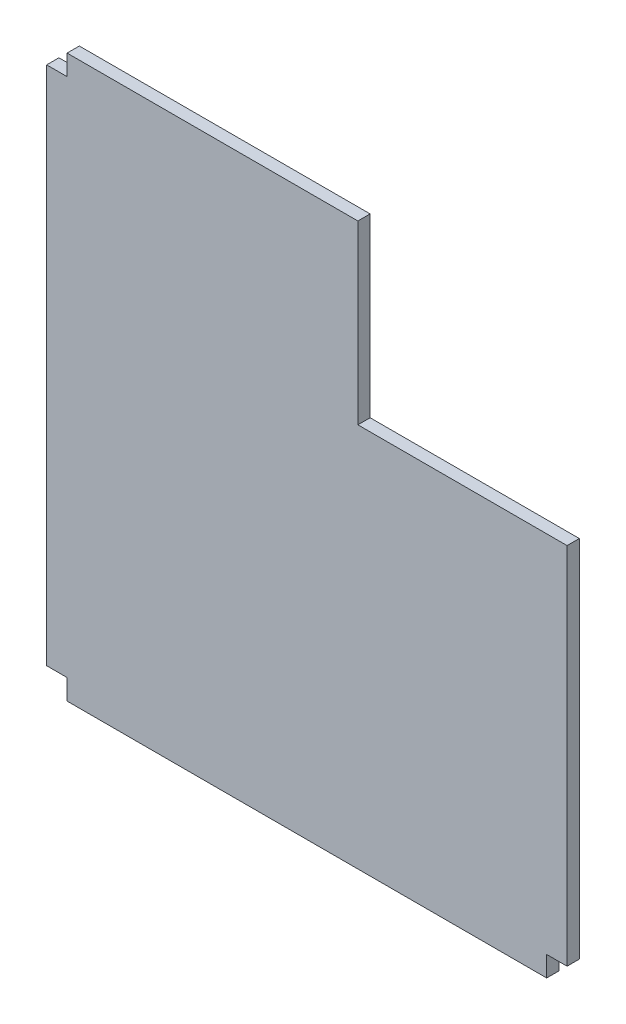
ISO-10303-21;
HEADER;
FILE_DESCRIPTION(('STEP AP214'),'2;1');
FILE_NAME('part.step','',(''),(''),'','','');
FILE_SCHEMA(('AUTOMOTIVE_DESIGN { 1 0 10303 214 1 1 1 1 }'));
ENDSEC;
DATA;
#1=APPLICATION_CONTEXT('core data for automotive mechanical design processes');
#2=APPLICATION_PROTOCOL_DEFINITION('international standard','automotive_design',2000,#1);
#3=PRODUCT_CONTEXT('',#1,'mechanical');
#4=PRODUCT('Part','Part','',(#3));
#5=PRODUCT_RELATED_PRODUCT_CATEGORY('part','',(#4));
#6=PRODUCT_DEFINITION_FORMATION('','',#4);
#7=PRODUCT_DEFINITION_CONTEXT('part definition',#1,'design');
#8=PRODUCT_DEFINITION('design','',#6,#7);
#9=PRODUCT_DEFINITION_SHAPE('','',#8);
#10=(LENGTH_UNIT() NAMED_UNIT(*) SI_UNIT(.MILLI.,.METRE.));
#11=(NAMED_UNIT(*) PLANE_ANGLE_UNIT() SI_UNIT($,.RADIAN.));
#12=(NAMED_UNIT(*) SI_UNIT($,.STERADIAN.) SOLID_ANGLE_UNIT());
#13=UNCERTAINTY_MEASURE_WITH_UNIT(LENGTH_MEASURE(1.E-05),#10,'distance_accuracy_value','');
#14=(GEOMETRIC_REPRESENTATION_CONTEXT(3) GLOBAL_UNCERTAINTY_ASSIGNED_CONTEXT((#13)) GLOBAL_UNIT_ASSIGNED_CONTEXT((#10,
#11,#12)) REPRESENTATION_CONTEXT('',''));
#15=CARTESIAN_POINT('',(0.,0.,0.));
#16=DIRECTION('',(0.,0.,1.));
#17=DIRECTION('',(1.,0.,0.));
#18=AXIS2_PLACEMENT_3D('',#15,#16,#17);
#19=CARTESIAN_POINT('',(255.,0.,12.));
#20=DIRECTION('',(1.,0.,0.));
#21=DIRECTION('',(0.,0.,-1.));
#22=AXIS2_PLACEMENT_3D('',#19,#20,#21);
#23=PLANE('',#22);
#24=DIRECTION('',(0.,-1.,0.));
#25=VECTOR('',#24,1.);
#26=CARTESIAN_POINT('',(255.,0.,0.));
#27=LINE('',#26,#25);
#28=CARTESIAN_POINT('',(255.,102.,0.));
#29=VERTEX_POINT('',#28);
#30=CARTESIAN_POINT('',(255.,-255.,0.));
#31=VERTEX_POINT('',#30);
#32=EDGE_CURVE('E155',#29,#31,#27,.T.);
#33=ORIENTED_EDGE('',*,*,#32,.F.);
#34=DIRECTION('',(0.,0.,1.));
#35=VECTOR('',#34,1.);
#36=CARTESIAN_POINT('',(255.,102.,12.));
#37=LINE('',#36,#35);
#38=CARTESIAN_POINT('',(255.,102.,12.));
#39=VERTEX_POINT('',#38);
#40=EDGE_CURVE('E152',#29,#39,#37,.T.);
#41=ORIENTED_EDGE('',*,*,#40,.T.);
#42=DIRECTION('',(0.,-1.,0.));
#43=VECTOR('',#42,1.);
#44=CARTESIAN_POINT('',(255.,0.,12.));
#45=LINE('',#44,#43);
#46=CARTESIAN_POINT('',(255.,-255.,12.));
#47=VERTEX_POINT('',#46);
#48=EDGE_CURVE('E190',#39,#47,#45,.T.);
#49=ORIENTED_EDGE('',*,*,#48,.T.);
#50=DIRECTION('',(0.,0.,-1.));
#51=VECTOR('',#50,1.);
#52=CARTESIAN_POINT('',(255.,-255.,12.));
#53=LINE('',#52,#51);
#54=EDGE_CURVE('E43',#47,#31,#53,.T.);
#55=ORIENTED_EDGE('',*,*,#54,.T.);
#56=EDGE_LOOP('',(#33,#41,#49,#55));
#57=FACE_BOUND('',#56,.T.);
#58=ADVANCED_FACE('F35',(#57),#23,.T.);
#59=CARTESIAN_POINT('',(0.,0.,12.));
#60=DIRECTION('',(0.,0.,1.));
#61=DIRECTION('',(1.,0.,0.));
#62=AXIS2_PLACEMENT_3D('',#59,#60,#61);
#63=PLANE('',#62);
#64=ORIENTED_EDGE('',*,*,#48,.F.);
#65=DIRECTION('',(1.,0.,0.));
#66=VECTOR('',#65,1.);
#67=CARTESIAN_POINT('',(0.,102.,12.));
#68=LINE('',#67,#66);
#69=CARTESIAN_POINT('',(50.,102.,12.));
#70=VERTEX_POINT('',#69);
#71=EDGE_CURVE('E264',#70,#39,#68,.T.);
#72=ORIENTED_EDGE('',*,*,#71,.F.);
#73=DIRECTION('',(0.,1.,0.));
#74=VECTOR('',#73,1.);
#75=CARTESIAN_POINT('',(50.,0.,12.));
#76=LINE('',#75,#74);
#77=CARTESIAN_POINT('',(50.,275.,12.));
#78=VERTEX_POINT('',#77);
#79=EDGE_CURVE('E249',#70,#78,#76,.T.);
#80=ORIENTED_EDGE('',*,*,#79,.T.);
#81=DIRECTION('',(1.,0.,0.));
#82=VECTOR('',#81,1.);
#83=CARTESIAN_POINT('',(0.,275.,12.));
#84=LINE('',#83,#82);
#85=CARTESIAN_POINT('',(-235.,275.,12.));
#86=VERTEX_POINT('',#85);
#87=EDGE_CURVE('E261',#86,#78,#84,.T.);
#88=ORIENTED_EDGE('',*,*,#87,.F.);
#89=DIRECTION('',(0.,1.,0.));
#90=VECTOR('',#89,1.);
#91=CARTESIAN_POINT('',(-235.,0.,12.));
#92=LINE('',#91,#90);
#93=CARTESIAN_POINT('',(-235.,255.,12.));
#94=VERTEX_POINT('',#93);
#95=EDGE_CURVE('E266',#94,#86,#92,.T.);
#96=ORIENTED_EDGE('',*,*,#95,.F.);
#97=DIRECTION('',(-1.,0.,0.));
#98=VECTOR('',#97,1.);
#99=CARTESIAN_POINT('',(0.,255.,12.));
#100=LINE('',#99,#98);
#101=CARTESIAN_POINT('',(-255.,255.,12.));
#102=VERTEX_POINT('',#101);
#103=EDGE_CURVE('E144',#94,#102,#100,.T.);
#104=ORIENTED_EDGE('',*,*,#103,.T.);
#105=DIRECTION('',(0.,1.,0.));
#106=VECTOR('',#105,1.);
#107=CARTESIAN_POINT('',(-255.,0.,12.));
#108=LINE('',#107,#106);
#109=CARTESIAN_POINT('',(-255.,-255.,12.));
#110=VERTEX_POINT('',#109);
#111=EDGE_CURVE('E142',#110,#102,#108,.T.);
#112=ORIENTED_EDGE('',*,*,#111,.F.);
#113=DIRECTION('',(-1.,0.,0.));
#114=VECTOR('',#113,1.);
#115=CARTESIAN_POINT('',(-7.0776717819854E-13,-255.000000000001,12.));
#116=LINE('',#115,#114);
#117=CARTESIAN_POINT('',(-235.,-255.,12.));
#118=VERTEX_POINT('',#117);
#119=EDGE_CURVE('E122',#118,#110,#116,.T.);
#120=ORIENTED_EDGE('',*,*,#119,.F.);
#121=DIRECTION('',(0.,-1.,0.));
#122=VECTOR('',#121,1.);
#123=CARTESIAN_POINT('',(-235.,3.2612801348364E-13,12.));
#124=LINE('',#123,#122);
#125=CARTESIAN_POINT('',(-235.,-275.,12.));
#126=VERTEX_POINT('',#125);
#127=EDGE_CURVE('E132',#118,#126,#124,.T.);
#128=ORIENTED_EDGE('',*,*,#127,.T.);
#129=DIRECTION('',(-1.,0.,0.));
#130=VECTOR('',#129,1.);
#131=CARTESIAN_POINT('',(0.,-275.,12.));
#132=LINE('',#131,#130);
#133=CARTESIAN_POINT('',(235.,-275.,12.));
#134=VERTEX_POINT('',#133);
#135=EDGE_CURVE('E136',#134,#126,#132,.T.);
#136=ORIENTED_EDGE('',*,*,#135,.F.);
#137=DIRECTION('',(0.,-1.,0.));
#138=VECTOR('',#137,1.);
#139=CARTESIAN_POINT('',(235.,3.26128013483639E-13,12.));
#140=LINE('',#139,#138);
#141=CARTESIAN_POINT('',(235.,-255.,12.));
#142=VERTEX_POINT('',#141);
#143=EDGE_CURVE('E175',#142,#134,#140,.T.);
#144=ORIENTED_EDGE('',*,*,#143,.F.);
#145=DIRECTION('',(1.,0.,0.));
#146=VECTOR('',#145,1.);
#147=CARTESIAN_POINT('',(0.,-255.,12.));
#148=LINE('',#147,#146);
#149=EDGE_CURVE('E269',#142,#47,#148,.T.);
#150=ORIENTED_EDGE('',*,*,#149,.T.);
#151=EDGE_LOOP('',(#64,#72,#80,#88,#96,#104,#112,#120,#128,#136,#144,#150));
#152=FACE_BOUND('',#151,.T.);
#153=ADVANCED_FACE('F140',(#152),#63,.T.);
#154=CARTESIAN_POINT('',(0.,0.,0.));
#155=DIRECTION('',(0.,0.,1.));
#156=DIRECTION('',(1.,0.,0.));
#157=AXIS2_PLACEMENT_3D('',#154,#155,#156);
#158=PLANE('',#157);
#159=DIRECTION('',(1.,0.,0.));
#160=VECTOR('',#159,1.);
#161=CARTESIAN_POINT('',(0.,102.,0.));
#162=LINE('',#161,#160);
#163=CARTESIAN_POINT('',(50.,102.,0.));
#164=VERTEX_POINT('',#163);
#165=EDGE_CURVE('E50',#164,#29,#162,.T.);
#166=ORIENTED_EDGE('',*,*,#165,.T.);
#167=ORIENTED_EDGE('',*,*,#32,.T.);
#168=DIRECTION('',(1.,0.,0.));
#169=VECTOR('',#168,1.);
#170=CARTESIAN_POINT('',(0.,-255.,0.));
#171=LINE('',#170,#169);
#172=CARTESIAN_POINT('',(235.,-255.,0.));
#173=VERTEX_POINT('',#172);
#174=EDGE_CURVE('E151',#173,#31,#171,.T.);
#175=ORIENTED_EDGE('',*,*,#174,.F.);
#176=DIRECTION('',(0.,-1.,0.));
#177=VECTOR('',#176,1.);
#178=CARTESIAN_POINT('',(235.,3.26128013483639E-13,0.));
#179=LINE('',#178,#177);
#180=CARTESIAN_POINT('',(235.,-275.,0.));
#181=VERTEX_POINT('',#180);
#182=EDGE_CURVE('E149',#173,#181,#179,.T.);
#183=ORIENTED_EDGE('',*,*,#182,.T.);
#184=DIRECTION('',(-1.,0.,0.));
#185=VECTOR('',#184,1.);
#186=CARTESIAN_POINT('',(0.,-275.,0.));
#187=LINE('',#186,#185);
#188=CARTESIAN_POINT('',(-235.,-275.,0.));
#189=VERTEX_POINT('',#188);
#190=EDGE_CURVE('E172',#181,#189,#187,.T.);
#191=ORIENTED_EDGE('',*,*,#190,.T.);
#192=DIRECTION('',(0.,-1.,0.));
#193=VECTOR('',#192,1.);
#194=CARTESIAN_POINT('',(-235.,3.2612801348364E-13,0.));
#195=LINE('',#194,#193);
#196=CARTESIAN_POINT('',(-235.,-255.,0.));
#197=VERTEX_POINT('',#196);
#198=EDGE_CURVE('E170',#197,#189,#195,.T.);
#199=ORIENTED_EDGE('',*,*,#198,.F.);
#200=DIRECTION('',(-1.,0.,0.));
#201=VECTOR('',#200,1.);
#202=CARTESIAN_POINT('',(-7.0776717819854E-13,-255.000000000001,0.));
#203=LINE('',#202,#201);
#204=CARTESIAN_POINT('',(-255.,-255.,0.));
#205=VERTEX_POINT('',#204);
#206=EDGE_CURVE('E124',#197,#205,#203,.T.);
#207=ORIENTED_EDGE('',*,*,#206,.T.);
#208=DIRECTION('',(0.,1.,0.));
#209=VECTOR('',#208,1.);
#210=CARTESIAN_POINT('',(-255.,0.,0.));
#211=LINE('',#210,#209);
#212=CARTESIAN_POINT('',(-255.,255.,0.));
#213=VERTEX_POINT('',#212);
#214=EDGE_CURVE('E166',#205,#213,#211,.T.);
#215=ORIENTED_EDGE('',*,*,#214,.T.);
#216=DIRECTION('',(-1.,0.,0.));
#217=VECTOR('',#216,1.);
#218=CARTESIAN_POINT('',(0.,255.,0.));
#219=LINE('',#218,#217);
#220=CARTESIAN_POINT('',(-235.,255.,0.));
#221=VERTEX_POINT('',#220);
#222=EDGE_CURVE('E163',#221,#213,#219,.T.);
#223=ORIENTED_EDGE('',*,*,#222,.F.);
#224=DIRECTION('',(0.,1.,0.));
#225=VECTOR('',#224,1.);
#226=CARTESIAN_POINT('',(-235.,0.,0.));
#227=LINE('',#226,#225);
#228=CARTESIAN_POINT('',(-235.,275.,0.));
#229=VERTEX_POINT('',#228);
#230=EDGE_CURVE('E160',#221,#229,#227,.T.);
#231=ORIENTED_EDGE('',*,*,#230,.T.);
#232=DIRECTION('',(1.,0.,0.));
#233=VECTOR('',#232,1.);
#234=CARTESIAN_POINT('',(0.,275.,0.));
#235=LINE('',#234,#233);
#236=CARTESIAN_POINT('',(50.,275.,0.));
#237=VERTEX_POINT('',#236);
#238=EDGE_CURVE('E157',#229,#237,#235,.T.);
#239=ORIENTED_EDGE('',*,*,#238,.T.);
#240=DIRECTION('',(0.,1.,0.));
#241=VECTOR('',#240,1.);
#242=CARTESIAN_POINT('',(50.,0.,0.));
#243=LINE('',#242,#241);
#244=EDGE_CURVE('E253',#164,#237,#243,.T.);
#245=ORIENTED_EDGE('',*,*,#244,.F.);
#246=EDGE_LOOP('',(#166,#167,#175,#183,#191,#199,#207,#215,#223,#231,#239,#245));
#247=FACE_BOUND('',#246,.T.);
#248=ADVANCED_FACE('F196',(#247),#158,.F.);
#249=CARTESIAN_POINT('',(235.,3.26128013483639E-13,12.));
#250=DIRECTION('',(1.,0.,0.));
#251=DIRECTION('',(0.,1.,0.));
#252=AXIS2_PLACEMENT_3D('',#249,#250,#251);
#253=PLANE('',#252);
#254=ORIENTED_EDGE('',*,*,#182,.F.);
#255=DIRECTION('',(0.,0.,-1.));
#256=VECTOR('',#255,1.);
#257=CARTESIAN_POINT('',(235.,-255.,12.));
#258=LINE('',#257,#256);
#259=EDGE_CURVE('E11',#142,#173,#258,.T.);
#260=ORIENTED_EDGE('',*,*,#259,.F.);
#261=ORIENTED_EDGE('',*,*,#143,.T.);
#262=DIRECTION('',(0.,0.,-1.));
#263=VECTOR('',#262,1.);
#264=CARTESIAN_POINT('',(235.,-275.,12.));
#265=LINE('',#264,#263);
#266=EDGE_CURVE('E59',#134,#181,#265,.T.);
#267=ORIENTED_EDGE('',*,*,#266,.T.);
#268=EDGE_LOOP('',(#254,#260,#261,#267));
#269=FACE_BOUND('',#268,.T.);
#270=ADVANCED_FACE('F37',(#269),#253,.T.);
#271=CARTESIAN_POINT('',(0.,-255.,12.));
#272=DIRECTION('',(0.,1.,0.));
#273=DIRECTION('',(0.,0.,1.));
#274=AXIS2_PLACEMENT_3D('',#271,#272,#273);
#275=PLANE('',#274);
#276=ORIENTED_EDGE('',*,*,#174,.T.);
#277=ORIENTED_EDGE('',*,*,#54,.F.);
#278=ORIENTED_EDGE('',*,*,#149,.F.);
#279=ORIENTED_EDGE('',*,*,#259,.T.);
#280=EDGE_LOOP('',(#276,#277,#278,#279));
#281=FACE_BOUND('',#280,.T.);
#282=ADVANCED_FACE('F194',(#281),#275,.F.);
#283=CARTESIAN_POINT('',(0.,275.,12.));
#284=DIRECTION('',(0.,1.,0.));
#285=DIRECTION('',(0.,0.,1.));
#286=AXIS2_PLACEMENT_3D('',#283,#284,#285);
#287=PLANE('',#286);
#288=DIRECTION('',(0.,0.,1.));
#289=VECTOR('',#288,1.);
#290=CARTESIAN_POINT('',(50.,275.,12.));
#291=LINE('',#290,#289);
#292=EDGE_CURVE('E246',#237,#78,#291,.T.);
#293=ORIENTED_EDGE('',*,*,#292,.F.);
#294=ORIENTED_EDGE('',*,*,#238,.F.);
#295=DIRECTION('',(0.,0.,-1.));
#296=VECTOR('',#295,1.);
#297=CARTESIAN_POINT('',(-235.,275.,12.));
#298=LINE('',#297,#296);
#299=EDGE_CURVE('E183',#86,#229,#298,.T.);
#300=ORIENTED_EDGE('',*,*,#299,.F.);
#301=ORIENTED_EDGE('',*,*,#87,.T.);
#302=EDGE_LOOP('',(#293,#294,#300,#301));
#303=FACE_BOUND('',#302,.T.);
#304=ADVANCED_FACE('F202',(#303),#287,.T.);
#305=CARTESIAN_POINT('',(-235.,0.,12.));
#306=DIRECTION('',(-1.,0.,0.));
#307=DIRECTION('',(0.,0.,1.));
#308=AXIS2_PLACEMENT_3D('',#305,#306,#307);
#309=PLANE('',#308);
#310=ORIENTED_EDGE('',*,*,#230,.F.);
#311=DIRECTION('',(0.,0.,-1.));
#312=VECTOR('',#311,1.);
#313=CARTESIAN_POINT('',(-235.,255.,12.));
#314=LINE('',#313,#312);
#315=EDGE_CURVE('E181',#94,#221,#314,.T.);
#316=ORIENTED_EDGE('',*,*,#315,.F.);
#317=ORIENTED_EDGE('',*,*,#95,.T.);
#318=ORIENTED_EDGE('',*,*,#299,.T.);
#319=EDGE_LOOP('',(#310,#316,#317,#318));
#320=FACE_BOUND('',#319,.T.);
#321=ADVANCED_FACE('F213',(#320),#309,.T.);
#322=CARTESIAN_POINT('',(0.,255.,12.));
#323=DIRECTION('',(0.,-1.,0.));
#324=DIRECTION('',(0.,0.,-1.));
#325=AXIS2_PLACEMENT_3D('',#322,#323,#324);
#326=PLANE('',#325);
#327=ORIENTED_EDGE('',*,*,#222,.T.);
#328=DIRECTION('',(0.,0.,-1.));
#329=VECTOR('',#328,1.);
#330=CARTESIAN_POINT('',(-255.,255.,12.));
#331=LINE('',#330,#329);
#332=EDGE_CURVE('E179',#102,#213,#331,.T.);
#333=ORIENTED_EDGE('',*,*,#332,.F.);
#334=ORIENTED_EDGE('',*,*,#103,.F.);
#335=ORIENTED_EDGE('',*,*,#315,.T.);
#336=EDGE_LOOP('',(#327,#333,#334,#335));
#337=FACE_BOUND('',#336,.T.);
#338=ADVANCED_FACE('F217',(#337),#326,.F.);
#339=CARTESIAN_POINT('',(-255.,0.,12.));
#340=DIRECTION('',(-1.,0.,0.));
#341=DIRECTION('',(0.,0.,1.));
#342=AXIS2_PLACEMENT_3D('',#339,#340,#341);
#343=PLANE('',#342);
#344=ORIENTED_EDGE('',*,*,#214,.F.);
#345=DIRECTION('',(0.,0.,-1.));
#346=VECTOR('',#345,1.);
#347=CARTESIAN_POINT('',(-255.,-255.,12.));
#348=LINE('',#347,#346);
#349=EDGE_CURVE('E128',#110,#205,#348,.T.);
#350=ORIENTED_EDGE('',*,*,#349,.F.);
#351=ORIENTED_EDGE('',*,*,#111,.T.);
#352=ORIENTED_EDGE('',*,*,#332,.T.);
#353=EDGE_LOOP('',(#344,#350,#351,#352));
#354=FACE_BOUND('',#353,.T.);
#355=ADVANCED_FACE('F221',(#354),#343,.T.);
#356=CARTESIAN_POINT('',(-7.0776717819854E-13,-255.000000000001,12.));
#357=DIRECTION('',(0.,-1.,0.));
#358=DIRECTION('',(1.,0.,0.));
#359=AXIS2_PLACEMENT_3D('',#356,#357,#358);
#360=PLANE('',#359);
#361=ORIENTED_EDGE('',*,*,#206,.F.);
#362=DIRECTION('',(0.,0.,-1.));
#363=VECTOR('',#362,1.);
#364=CARTESIAN_POINT('',(-235.,-255.,12.));
#365=LINE('',#364,#363);
#366=EDGE_CURVE('E118',#118,#197,#365,.T.);
#367=ORIENTED_EDGE('',*,*,#366,.F.);
#368=ORIENTED_EDGE('',*,*,#119,.T.);
#369=ORIENTED_EDGE('',*,*,#349,.T.);
#370=EDGE_LOOP('',(#361,#367,#368,#369));
#371=FACE_BOUND('',#370,.T.);
#372=ADVANCED_FACE('F120',(#371),#360,.T.);
#373=CARTESIAN_POINT('',(-235.,3.2612801348364E-13,12.));
#374=DIRECTION('',(1.,0.,0.));
#375=DIRECTION('',(0.,1.,0.));
#376=AXIS2_PLACEMENT_3D('',#373,#374,#375);
#377=PLANE('',#376);
#378=ORIENTED_EDGE('',*,*,#198,.T.);
#379=DIRECTION('',(0.,0.,-1.));
#380=VECTOR('',#379,1.);
#381=CARTESIAN_POINT('',(-235.,-275.,12.));
#382=LINE('',#381,#380);
#383=EDGE_CURVE('E129',#126,#189,#382,.T.);
#384=ORIENTED_EDGE('',*,*,#383,.F.);
#385=ORIENTED_EDGE('',*,*,#127,.F.);
#386=ORIENTED_EDGE('',*,*,#366,.T.);
#387=EDGE_LOOP('',(#378,#384,#385,#386));
#388=FACE_BOUND('',#387,.T.);
#389=ADVANCED_FACE('F133',(#388),#377,.F.);
#390=CARTESIAN_POINT('',(0.,-275.,12.));
#391=DIRECTION('',(0.,-1.,0.));
#392=DIRECTION('',(1.,0.,0.));
#393=AXIS2_PLACEMENT_3D('',#390,#391,#392);
#394=PLANE('',#393);
#395=ORIENTED_EDGE('',*,*,#190,.F.);
#396=ORIENTED_EDGE('',*,*,#266,.F.);
#397=ORIENTED_EDGE('',*,*,#135,.T.);
#398=ORIENTED_EDGE('',*,*,#383,.T.);
#399=EDGE_LOOP('',(#395,#396,#397,#398));
#400=FACE_BOUND('',#399,.T.);
#401=ADVANCED_FACE('F230',(#400),#394,.T.);
#402=CARTESIAN_POINT('',(0.,102.,12.));
#403=DIRECTION('',(0.,1.,0.));
#404=DIRECTION('',(-1.,0.,0.));
#405=AXIS2_PLACEMENT_3D('',#402,#403,#404);
#406=PLANE('',#405);
#407=ORIENTED_EDGE('',*,*,#165,.F.);
#408=DIRECTION('',(0.,0.,-1.));
#409=VECTOR('',#408,1.);
#410=CARTESIAN_POINT('',(50.,102.,12.));
#411=LINE('',#410,#409);
#412=EDGE_CURVE('E257',#70,#164,#411,.T.);
#413=ORIENTED_EDGE('',*,*,#412,.F.);
#414=ORIENTED_EDGE('',*,*,#71,.T.);
#415=ORIENTED_EDGE('',*,*,#40,.F.);
#416=EDGE_LOOP('',(#407,#413,#414,#415));
#417=FACE_BOUND('',#416,.T.);
#418=ADVANCED_FACE('F232',(#417),#406,.T.);
#419=CARTESIAN_POINT('',(50.,0.,12.));
#420=DIRECTION('',(-1.,0.,0.));
#421=DIRECTION('',(0.,-1.,0.));
#422=AXIS2_PLACEMENT_3D('',#419,#420,#421);
#423=PLANE('',#422);
#424=ORIENTED_EDGE('',*,*,#292,.T.);
#425=ORIENTED_EDGE('',*,*,#79,.F.);
#426=ORIENTED_EDGE('',*,*,#412,.T.);
#427=ORIENTED_EDGE('',*,*,#244,.T.);
#428=EDGE_LOOP('',(#424,#425,#426,#427));
#429=FACE_BOUND('',#428,.T.);
#430=ADVANCED_FACE('F236',(#429),#423,.F.);
#431=CLOSED_SHELL('',(#58,#153,#248,#270,#282,#304,#321,#338,#355,#372,#389,#401,#418,#430));
#432=MANIFOLD_SOLID_BREP('B2',#431);
#433=ADVANCED_BREP_SHAPE_REPRESENTATION('',(#18,#432),#14);
#434=SHAPE_DEFINITION_REPRESENTATION(#9,#433);
ENDSEC;
END-ISO-10303-21;
